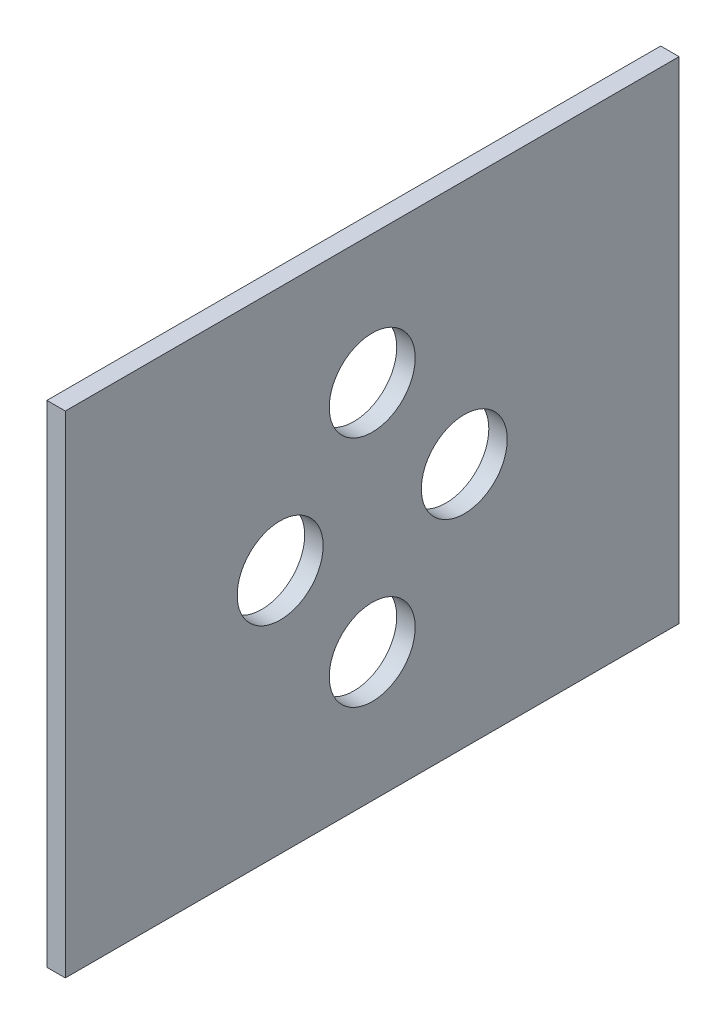
ISO-10303-21;
HEADER;
FILE_DESCRIPTION(('STEP AP214'),'2;1');
FILE_NAME('part.step','',(''),(''),'','','');
FILE_SCHEMA(('AUTOMOTIVE_DESIGN { 1 0 10303 214 1 1 1 1 }'));
ENDSEC;
DATA;
#1=APPLICATION_CONTEXT('core data for automotive mechanical design processes');
#2=APPLICATION_PROTOCOL_DEFINITION('international standard','automotive_design',2000,#1);
#3=PRODUCT_CONTEXT('',#1,'mechanical');
#4=PRODUCT('Part','Part','',(#3));
#5=PRODUCT_RELATED_PRODUCT_CATEGORY('part','',(#4));
#6=PRODUCT_DEFINITION_FORMATION('','',#4);
#7=PRODUCT_DEFINITION_CONTEXT('part definition',#1,'design');
#8=PRODUCT_DEFINITION('design','',#6,#7);
#9=PRODUCT_DEFINITION_SHAPE('','',#8);
#10=(LENGTH_UNIT() NAMED_UNIT(*) SI_UNIT(.MILLI.,.METRE.));
#11=(NAMED_UNIT(*) PLANE_ANGLE_UNIT() SI_UNIT($,.RADIAN.));
#12=(NAMED_UNIT(*) SI_UNIT($,.STERADIAN.) SOLID_ANGLE_UNIT());
#13=UNCERTAINTY_MEASURE_WITH_UNIT(LENGTH_MEASURE(1.E-05),#10,'distance_accuracy_value','');
#14=(GEOMETRIC_REPRESENTATION_CONTEXT(3) GLOBAL_UNCERTAINTY_ASSIGNED_CONTEXT((#13)) GLOBAL_UNIT_ASSIGNED_CONTEXT((#10,
#11,#12)) REPRESENTATION_CONTEXT('',''));
#15=CARTESIAN_POINT('',(0.,0.,0.));
#16=DIRECTION('',(0.,0.,1.));
#17=DIRECTION('',(1.,0.,0.));
#18=AXIS2_PLACEMENT_3D('',#15,#16,#17);
#19=CARTESIAN_POINT('',(1.5,-20.,-25.));
#20=DIRECTION('',(0.,0.,1.));
#21=DIRECTION('',(1.,0.,0.));
#22=AXIS2_PLACEMENT_3D('',#19,#20,#21);
#23=PLANE('',#22);
#24=DIRECTION('',(0.,1.,0.));
#25=VECTOR('',#24,1.);
#26=CARTESIAN_POINT('',(0.,-20.,-25.));
#27=LINE('',#26,#25);
#28=CARTESIAN_POINT('',(0.,-20.,-25.));
#29=VERTEX_POINT('',#28);
#30=CARTESIAN_POINT('',(0.,20.,-25.));
#31=VERTEX_POINT('',#30);
#32=EDGE_CURVE('E116',#29,#31,#27,.T.);
#33=ORIENTED_EDGE('',*,*,#32,.T.);
#34=DIRECTION('',(-1.,0.,0.));
#35=VECTOR('',#34,1.);
#36=CARTESIAN_POINT('',(1.5,20.,-25.));
#37=LINE('',#36,#35);
#38=CARTESIAN_POINT('',(1.5,20.,-25.));
#39=VERTEX_POINT('',#38);
#40=EDGE_CURVE('E11',#39,#31,#37,.T.);
#41=ORIENTED_EDGE('',*,*,#40,.F.);
#42=DIRECTION('',(0.,1.,0.));
#43=VECTOR('',#42,1.);
#44=CARTESIAN_POINT('',(1.5,-20.,-25.));
#45=LINE('',#44,#43);
#46=CARTESIAN_POINT('',(1.5,-20.,-25.));
#47=VERTEX_POINT('',#46);
#48=EDGE_CURVE('E99',#47,#39,#45,.T.);
#49=ORIENTED_EDGE('',*,*,#48,.F.);
#50=DIRECTION('',(-1.,0.,0.));
#51=VECTOR('',#50,1.);
#52=CARTESIAN_POINT('',(1.5,-20.,-25.));
#53=LINE('',#52,#51);
#54=EDGE_CURVE('E112',#47,#29,#53,.T.);
#55=ORIENTED_EDGE('',*,*,#54,.T.);
#56=EDGE_LOOP('',(#33,#41,#49,#55));
#57=FACE_BOUND('',#56,.T.);
#58=ADVANCED_FACE('F45',(#57),#23,.F.);
#59=CARTESIAN_POINT('',(1.5,20.,25.));
#60=DIRECTION('',(0.,-1.,0.));
#61=DIRECTION('',(0.,0.,-1.));
#62=AXIS2_PLACEMENT_3D('',#59,#60,#61);
#63=PLANE('',#62);
#64=DIRECTION('',(0.,0.,1.));
#65=VECTOR('',#64,1.);
#66=CARTESIAN_POINT('',(0.,20.,25.));
#67=LINE('',#66,#65);
#68=CARTESIAN_POINT('',(0.,20.,25.));
#69=VERTEX_POINT('',#68);
#70=EDGE_CURVE('E104',#31,#69,#67,.T.);
#71=ORIENTED_EDGE('',*,*,#70,.T.);
#72=DIRECTION('',(-1.,0.,0.));
#73=VECTOR('',#72,1.);
#74=CARTESIAN_POINT('',(1.5,20.,25.));
#75=LINE('',#74,#73);
#76=CARTESIAN_POINT('',(1.5,20.,25.));
#77=VERTEX_POINT('',#76);
#78=EDGE_CURVE('E55',#77,#69,#75,.T.);
#79=ORIENTED_EDGE('',*,*,#78,.F.);
#80=DIRECTION('',(0.,0.,1.));
#81=VECTOR('',#80,1.);
#82=CARTESIAN_POINT('',(1.5,20.,25.));
#83=LINE('',#82,#81);
#84=EDGE_CURVE('E94',#39,#77,#83,.T.);
#85=ORIENTED_EDGE('',*,*,#84,.F.);
#86=ORIENTED_EDGE('',*,*,#40,.T.);
#87=EDGE_LOOP('',(#71,#79,#85,#86));
#88=FACE_BOUND('',#87,.T.);
#89=ADVANCED_FACE('F103',(#88),#63,.F.);
#90=CARTESIAN_POINT('',(1.5,-20.,25.));
#91=DIRECTION('',(0.,0.,-1.));
#92=DIRECTION('',(-1.,0.,0.));
#93=AXIS2_PLACEMENT_3D('',#90,#91,#92);
#94=PLANE('',#93);
#95=DIRECTION('',(0.,-1.,0.));
#96=VECTOR('',#95,1.);
#97=CARTESIAN_POINT('',(0.,-20.,25.));
#98=LINE('',#97,#96);
#99=CARTESIAN_POINT('',(0.,-20.,25.));
#100=VERTEX_POINT('',#99);
#101=EDGE_CURVE('E81',#69,#100,#98,.T.);
#102=ORIENTED_EDGE('',*,*,#101,.T.);
#103=DIRECTION('',(-1.,0.,0.));
#104=VECTOR('',#103,1.);
#105=CARTESIAN_POINT('',(1.5,-20.,25.));
#106=LINE('',#105,#104);
#107=CARTESIAN_POINT('',(1.5,-20.,25.));
#108=VERTEX_POINT('',#107);
#109=EDGE_CURVE('E106',#108,#100,#106,.T.);
#110=ORIENTED_EDGE('',*,*,#109,.F.);
#111=DIRECTION('',(0.,-1.,0.));
#112=VECTOR('',#111,1.);
#113=CARTESIAN_POINT('',(1.5,-20.,25.));
#114=LINE('',#113,#112);
#115=EDGE_CURVE('E97',#77,#108,#114,.T.);
#116=ORIENTED_EDGE('',*,*,#115,.F.);
#117=ORIENTED_EDGE('',*,*,#78,.T.);
#118=EDGE_LOOP('',(#102,#110,#116,#117));
#119=FACE_BOUND('',#118,.T.);
#120=ADVANCED_FACE('F108',(#119),#94,.F.);
#121=CARTESIAN_POINT('',(1.5,-20.,25.));
#122=DIRECTION('',(0.,1.,0.));
#123=DIRECTION('',(0.,0.,1.));
#124=AXIS2_PLACEMENT_3D('',#121,#122,#123);
#125=PLANE('',#124);
#126=DIRECTION('',(0.,0.,-1.));
#127=VECTOR('',#126,1.);
#128=CARTESIAN_POINT('',(0.,-20.,25.));
#129=LINE('',#128,#127);
#130=EDGE_CURVE('E87',#100,#29,#129,.T.);
#131=ORIENTED_EDGE('',*,*,#130,.T.);
#132=ORIENTED_EDGE('',*,*,#54,.F.);
#133=DIRECTION('',(0.,0.,-1.));
#134=VECTOR('',#133,1.);
#135=CARTESIAN_POINT('',(1.5,-20.,25.));
#136=LINE('',#135,#134);
#137=EDGE_CURVE('E64',#108,#47,#136,.T.);
#138=ORIENTED_EDGE('',*,*,#137,.F.);
#139=ORIENTED_EDGE('',*,*,#109,.T.);
#140=EDGE_LOOP('',(#131,#132,#138,#139));
#141=FACE_BOUND('',#140,.T.);
#142=ADVANCED_FACE('F162',(#141),#125,.F.);
#143=CARTESIAN_POINT('',(1.5,0.,0.));
#144=DIRECTION('',(-1.,0.,0.));
#145=DIRECTION('',(0.,0.,1.));
#146=AXIS2_PLACEMENT_3D('',#143,#144,#145);
#147=PLANE('',#146);
#148=CARTESIAN_POINT('',(1.5,9.5,0.));
#149=DIRECTION('',(1.,0.,0.));
#150=DIRECTION('',(0.,0.,-1.));
#151=AXIS2_PLACEMENT_3D('',#148,#149,#150);
#152=CIRCLE('',#151,3.5);
#153=CARTESIAN_POINT('',(1.5,9.5,-3.5));
#154=VERTEX_POINT('',#153);
#155=EDGE_CURVE('E135',#154,#154,#152,.T.);
#156=ORIENTED_EDGE('',*,*,#155,.F.);
#157=EDGE_LOOP('',(#156));
#158=FACE_BOUND('',#157,.T.);
#159=CARTESIAN_POINT('',(1.5,-9.5,0.));
#160=DIRECTION('',(1.,0.,0.));
#161=DIRECTION('',(0.,0.,-1.));
#162=AXIS2_PLACEMENT_3D('',#159,#160,#161);
#163=CIRCLE('',#162,3.5);
#164=CARTESIAN_POINT('',(1.5,-9.5,-3.5));
#165=VERTEX_POINT('',#164);
#166=EDGE_CURVE('E242',#165,#165,#163,.T.);
#167=ORIENTED_EDGE('',*,*,#166,.F.);
#168=EDGE_LOOP('',(#167));
#169=FACE_BOUND('',#168,.T.);
#170=CARTESIAN_POINT('',(1.5,0.,-7.5));
#171=DIRECTION('',(1.,0.,0.));
#172=DIRECTION('',(0.,0.,-1.));
#173=AXIS2_PLACEMENT_3D('',#170,#171,#172);
#174=CIRCLE('',#173,3.5);
#175=CARTESIAN_POINT('',(1.5,0.,-11.));
#176=VERTEX_POINT('',#175);
#177=EDGE_CURVE('E245',#176,#176,#174,.T.);
#178=ORIENTED_EDGE('',*,*,#177,.F.);
#179=EDGE_LOOP('',(#178));
#180=FACE_BOUND('',#179,.T.);
#181=CARTESIAN_POINT('',(1.5,0.,7.5));
#182=DIRECTION('',(1.,0.,0.));
#183=DIRECTION('',(0.,0.,-1.));
#184=AXIS2_PLACEMENT_3D('',#181,#182,#183);
#185=CIRCLE('',#184,3.5);
#186=CARTESIAN_POINT('',(1.5,0.,4.));
#187=VERTEX_POINT('',#186);
#188=EDGE_CURVE('E252',#187,#187,#185,.T.);
#189=ORIENTED_EDGE('',*,*,#188,.F.);
#190=EDGE_LOOP('',(#189));
#191=FACE_BOUND('',#190,.T.);
#192=ORIENTED_EDGE('',*,*,#48,.T.);
#193=ORIENTED_EDGE('',*,*,#84,.T.);
#194=ORIENTED_EDGE('',*,*,#115,.T.);
#195=ORIENTED_EDGE('',*,*,#137,.T.);
#196=EDGE_LOOP('',(#192,#193,#194,#195));
#197=FACE_BOUND('',#196,.T.);
#198=ADVANCED_FACE('F95',(#158,#169,#180,#191,#197),#147,.F.);
#199=CARTESIAN_POINT('',(0.,0.,0.));
#200=DIRECTION('',(-1.,0.,0.));
#201=DIRECTION('',(0.,0.,1.));
#202=AXIS2_PLACEMENT_3D('',#199,#200,#201);
#203=PLANE('',#202);
#204=CARTESIAN_POINT('',(0.,9.5,0.));
#205=DIRECTION('',(-1.,0.,0.));
#206=DIRECTION('',(0.,0.,1.));
#207=AXIS2_PLACEMENT_3D('',#204,#205,#206);
#208=CIRCLE('',#207,3.5);
#209=CARTESIAN_POINT('',(0.,9.5,3.5));
#210=VERTEX_POINT('',#209);
#211=EDGE_CURVE('E48',#210,#210,#208,.T.);
#212=ORIENTED_EDGE('',*,*,#211,.F.);
#213=EDGE_LOOP('',(#212));
#214=FACE_BOUND('',#213,.T.);
#215=CARTESIAN_POINT('',(0.,-9.5,0.));
#216=DIRECTION('',(-1.,0.,0.));
#217=DIRECTION('',(0.,0.,1.));
#218=AXIS2_PLACEMENT_3D('',#215,#216,#217);
#219=CIRCLE('',#218,3.5);
#220=CARTESIAN_POINT('',(0.,-9.5,3.5));
#221=VERTEX_POINT('',#220);
#222=EDGE_CURVE('E138',#221,#221,#219,.T.);
#223=ORIENTED_EDGE('',*,*,#222,.F.);
#224=EDGE_LOOP('',(#223));
#225=FACE_BOUND('',#224,.T.);
#226=CARTESIAN_POINT('',(0.,0.,-7.5));
#227=DIRECTION('',(-1.,0.,0.));
#228=DIRECTION('',(0.,0.,1.));
#229=AXIS2_PLACEMENT_3D('',#226,#227,#228);
#230=CIRCLE('',#229,3.5);
#231=CARTESIAN_POINT('',(0.,0.,-4.));
#232=VERTEX_POINT('',#231);
#233=EDGE_CURVE('E134',#232,#232,#230,.T.);
#234=ORIENTED_EDGE('',*,*,#233,.F.);
#235=EDGE_LOOP('',(#234));
#236=FACE_BOUND('',#235,.T.);
#237=CARTESIAN_POINT('',(0.,0.,7.5));
#238=DIRECTION('',(-1.,0.,0.));
#239=DIRECTION('',(0.,0.,1.));
#240=AXIS2_PLACEMENT_3D('',#237,#238,#239);
#241=CIRCLE('',#240,3.5);
#242=CARTESIAN_POINT('',(0.,0.,11.));
#243=VERTEX_POINT('',#242);
#244=EDGE_CURVE('E130',#243,#243,#241,.T.);
#245=ORIENTED_EDGE('',*,*,#244,.F.);
#246=EDGE_LOOP('',(#245));
#247=FACE_BOUND('',#246,.T.);
#248=ORIENTED_EDGE('',*,*,#32,.F.);
#249=ORIENTED_EDGE('',*,*,#130,.F.);
#250=ORIENTED_EDGE('',*,*,#101,.F.);
#251=ORIENTED_EDGE('',*,*,#70,.F.);
#252=EDGE_LOOP('',(#248,#249,#250,#251));
#253=FACE_BOUND('',#252,.T.);
#254=ADVANCED_FACE('F150',(#214,#225,#236,#247,#253),#203,.T.);
#255=CARTESIAN_POINT('',(-10.,0.,7.5));
#256=DIRECTION('',(1.,0.,0.));
#257=DIRECTION('',(0.,0.,-1.));
#258=AXIS2_PLACEMENT_3D('',#255,#256,#257);
#259=CYLINDRICAL_SURFACE('',#258,3.5);
#260=ORIENTED_EDGE('',*,*,#244,.T.);
#261=EDGE_LOOP('',(#260));
#262=FACE_BOUND('',#261,.T.);
#263=ORIENTED_EDGE('',*,*,#188,.T.);
#264=EDGE_LOOP('',(#263));
#265=FACE_BOUND('',#264,.T.);
#266=ADVANCED_FACE('F153',(#262,#265),#259,.F.);
#267=CARTESIAN_POINT('',(-10.,0.,-7.5));
#268=DIRECTION('',(1.,0.,0.));
#269=DIRECTION('',(0.,0.,-1.));
#270=AXIS2_PLACEMENT_3D('',#267,#268,#269);
#271=CYLINDRICAL_SURFACE('',#270,3.5);
#272=ORIENTED_EDGE('',*,*,#233,.T.);
#273=EDGE_LOOP('',(#272));
#274=FACE_BOUND('',#273,.T.);
#275=ORIENTED_EDGE('',*,*,#177,.T.);
#276=EDGE_LOOP('',(#275));
#277=FACE_BOUND('',#276,.T.);
#278=ADVANCED_FACE('F209',(#274,#277),#271,.F.);
#279=CARTESIAN_POINT('',(-10.,-9.5,0.));
#280=DIRECTION('',(1.,0.,0.));
#281=DIRECTION('',(0.,0.,-1.));
#282=AXIS2_PLACEMENT_3D('',#279,#280,#281);
#283=CYLINDRICAL_SURFACE('',#282,3.5);
#284=ORIENTED_EDGE('',*,*,#222,.T.);
#285=EDGE_LOOP('',(#284));
#286=FACE_BOUND('',#285,.T.);
#287=ORIENTED_EDGE('',*,*,#166,.T.);
#288=EDGE_LOOP('',(#287));
#289=FACE_BOUND('',#288,.T.);
#290=ADVANCED_FACE('F219',(#286,#289),#283,.F.);
#291=CARTESIAN_POINT('',(-10.,9.5,0.));
#292=DIRECTION('',(1.,0.,0.));
#293=DIRECTION('',(0.,0.,-1.));
#294=AXIS2_PLACEMENT_3D('',#291,#292,#293);
#295=CYLINDRICAL_SURFACE('',#294,3.5);
#296=ORIENTED_EDGE('',*,*,#211,.T.);
#297=EDGE_LOOP('',(#296));
#298=FACE_BOUND('',#297,.T.);
#299=ORIENTED_EDGE('',*,*,#155,.T.);
#300=EDGE_LOOP('',(#299));
#301=FACE_BOUND('',#300,.T.);
#302=ADVANCED_FACE('F147',(#298,#301),#295,.F.);
#303=CLOSED_SHELL('',(#58,#89,#120,#142,#198,#254,#266,#278,#290,#302));
#304=MANIFOLD_SOLID_BREP('B2',#303);
#305=ADVANCED_BREP_SHAPE_REPRESENTATION('',(#18,#304),#14);
#306=SHAPE_DEFINITION_REPRESENTATION(#9,#305);
ENDSEC;
END-ISO-10303-21;
